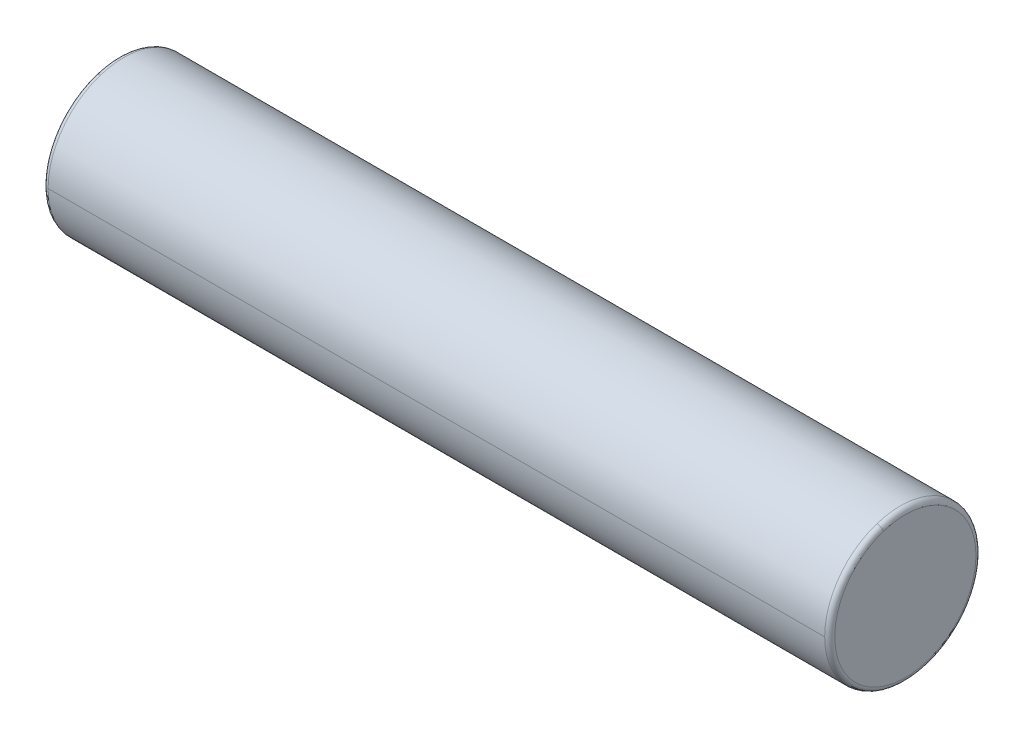
ISO-10303-21;
HEADER;
FILE_DESCRIPTION(('STEP AP214'),'2;1');
FILE_NAME('part.step','',(''),(''),'','','');
FILE_SCHEMA(('AUTOMOTIVE_DESIGN { 1 0 10303 214 1 1 1 1 }'));
ENDSEC;
DATA;
#1=APPLICATION_CONTEXT('core data for automotive mechanical design processes');
#2=APPLICATION_PROTOCOL_DEFINITION('international standard','automotive_design',2000,#1);
#3=PRODUCT_CONTEXT('',#1,'mechanical');
#4=PRODUCT('Part','Part','',(#3));
#5=PRODUCT_RELATED_PRODUCT_CATEGORY('part','',(#4));
#6=PRODUCT_DEFINITION_FORMATION('','',#4);
#7=PRODUCT_DEFINITION_CONTEXT('part definition',#1,'design');
#8=PRODUCT_DEFINITION('design','',#6,#7);
#9=PRODUCT_DEFINITION_SHAPE('','',#8);
#10=(LENGTH_UNIT() NAMED_UNIT(*) SI_UNIT(.MILLI.,.METRE.));
#11=(NAMED_UNIT(*) PLANE_ANGLE_UNIT() SI_UNIT($,.RADIAN.));
#12=(NAMED_UNIT(*) SI_UNIT($,.STERADIAN.) SOLID_ANGLE_UNIT());
#13=UNCERTAINTY_MEASURE_WITH_UNIT(LENGTH_MEASURE(1.E-05),#10,'distance_accuracy_value','');
#14=(GEOMETRIC_REPRESENTATION_CONTEXT(3) GLOBAL_UNCERTAINTY_ASSIGNED_CONTEXT((#13)) GLOBAL_UNIT_ASSIGNED_CONTEXT((#10,
#11,#12)) REPRESENTATION_CONTEXT('',''));
#15=CARTESIAN_POINT('',(0.,0.,0.));
#16=DIRECTION('',(0.,0.,1.));
#17=DIRECTION('',(1.,0.,0.));
#18=AXIS2_PLACEMENT_3D('',#15,#16,#17);
#19=CARTESIAN_POINT('',(2.1,3.25,0.));
#20=DIRECTION('',(1.,0.,0.));
#21=DIRECTION('',(0.,0.,-1.));
#22=AXIS2_PLACEMENT_3D('',#19,#20,#21);
#23=PLANE('',#22);
#24=CARTESIAN_POINT('',(2.1,3.91573956140652,0.216311896062434));
#25=CARTESIAN_POINT('',(2.1,3.91220039378035,0.227205120242794));
#26=CARTESIAN_POINT('',(2.1,3.90839342079429,0.238011307449353));
#27=CARTESIAN_POINT('',(2.1,3.90025403376515,0.259423954343163));
#28=CARTESIAN_POINT('',(2.1,3.89592161972208,0.270030414030415));
#29=CARTESIAN_POINT('',(2.1,3.88674152024174,0.291017952313907));
#30=CARTESIAN_POINT('',(2.1,3.88189383480447,0.301399030910147));
#31=CARTESIAN_POINT('',(2.1,3.87169494271154,0.321910825329425));
#32=CARTESIAN_POINT('',(2.1,3.86634373605587,0.332041541152462));
#33=CARTESIAN_POINT('',(2.1,3.85515067384589,0.352028196943182));
#34=CARTESIAN_POINT('',(2.1,3.84930881829157,0.361884136910865));
#35=CARTESIAN_POINT('',(2.1,3.8371485369722,0.381297499124348));
#36=CARTESIAN_POINT('',(2.1,3.83083011120713,0.390854921370148));
#37=CARTESIAN_POINT('',(2.1,3.81773190972843,0.409648222948401));
#38=CARTESIAN_POINT('',(2.1,3.8109521340148,0.418884102280853));
#39=CARTESIAN_POINT('',(2.1,3.79694756608198,0.437012068130574));
#40=CARTESIAN_POINT('',(2.1,3.78972277386278,0.445904154647843));
#41=CARTESIAN_POINT('',(2.1,3.77484557797712,0.463323113014291));
#42=CARTESIAN_POINT('',(2.1,3.76719317431064,0.47184998486347));
#43=CARTESIAN_POINT('',(2.1,3.75147919086763,0.48851797192267));
#44=CARTESIAN_POINT('',(2.1,3.7434176110911,0.496659087132692));
#45=CARTESIAN_POINT('',(2.1,3.72690469647266,0.512535948251258));
#46=CARTESIAN_POINT('',(2.1,3.71845336163076,0.520271694159802));
#47=CARTESIAN_POINT('',(2.1,3.70118129688937,0.535319180586672));
#48=CARTESIAN_POINT('',(2.1,3.69236056698989,0.542630921104998));
#49=CARTESIAN_POINT('',(2.1,3.67437096204376,0.556812782127896));
#50=CARTESIAN_POINT('',(2.1,3.66520208699712,0.563682902632468));
#51=CARTESIAN_POINT('',(2.1,3.64653828037989,0.576964972905863));
#52=CARTESIAN_POINT('',(2.1,3.63704334880931,0.583376922674686));
#53=CARTESIAN_POINT('',(2.1,3.61775030326599,0.595727204527956));
#54=CARTESIAN_POINT('',(2.1,3.60795218929324,0.601665536612403));
#55=CARTESIAN_POINT('',(2.1,3.58807638346038,0.613054277134795));
#56=CARTESIAN_POINT('',(2.1,3.57799869160026,0.618504685572741));
#57=CARTESIAN_POINT('',(2.1,3.55758800803502,0.628904448290805));
#58=CARTESIAN_POINT('',(2.1,3.54725501632991,0.633853802570923));
#59=CARTESIAN_POINT('',(2.1,3.52635862615678,0.643239533545359));
#60=CARTESIAN_POINT('',(2.1,3.51579522768877,0.647675910239676));
#61=CARTESIAN_POINT('',(2.1,3.49446347214198,0.656024998422473));
#62=CARTESIAN_POINT('',(2.1,3.4836951150632,0.659937709910952));
#63=CARTESIAN_POINT('',(2.1,3.46197938421031,0.667230041617384));
#64=CARTESIAN_POINT('',(2.1,3.45103201043618,0.670609661835336));
#65=CARTESIAN_POINT('',(2.1,3.42898461937487,0.676827669199589));
#66=CARTESIAN_POINT('',(2.1,3.41788460208769,0.679666056345889));
#67=CARTESIAN_POINT('',(2.1,3.39555866491416,0.68479475964359));
#68=CARTESIAN_POINT('',(2.1,3.38433274502782,0.68708507579499));
#69=CARTESIAN_POINT('',(2.1,3.36178204688025,0.691112119530673));
#70=CARTESIAN_POINT('',(2.1,3.35045726861902,0.692848847114956));
#71=CARTESIAN_POINT('',(2.1,3.32773613610444,0.695764529787534));
#72=CARTESIAN_POINT('',(2.1,3.31633978185109,0.69694348487583));
#73=CARTESIAN_POINT('',(2.1,3.29350295216788,0.698740782350362));
#74=CARTESIAN_POINT('',(2.1,3.28206247673801,0.699359124736598));
#75=CARTESIAN_POINT('',(2.1,3.25916496580913,0.700033707166043));
#76=CARTESIAN_POINT('',(2.1,3.24770793031013,0.700089947209252));
#77=CARTESIAN_POINT('',(2.1,3.224804900245,0.699640189465451));
#78=CARTESIAN_POINT('',(2.1,3.21335890567888,0.699134191678441));
#79=CARTESIAN_POINT('',(2.1,3.19050553188301,0.697561177267193));
#80=CARTESIAN_POINT('',(2.1,3.17909815265324,0.696494160642954));
#81=CARTESIAN_POINT('',(2.1,3.15634949090581,0.693801679093756));
#82=CARTESIAN_POINT('',(2.1,3.14500820838813,0.692176214168796));
#83=CARTESIAN_POINT('',(2.1,3.12241906220783,0.688370751905532));
#84=CARTESIAN_POINT('',(2.1,3.11117119854521,0.686190754567228));
#85=CARTESIAN_POINT('',(2.1,3.08879598716377,0.68128147928181));
#86=CARTESIAN_POINT('',(2.1,3.07766863944495,0.678552201334696));
#87=CARTESIAN_POINT('',(2.1,3.05556126670643,0.672550939901289));
#88=CARTESIAN_POINT('',(2.1,3.04458124168672,0.669278956414996));
#89=CARTESIAN_POINT('',(2.1,3.02279496618842,0.662200166398041));
#90=CARTESIAN_POINT('',(2.1,3.01198871570982,0.658393359867379));
#91=CARTESIAN_POINT('',(2.1,2.99057602249767,0.650254094692056));
#92=CARTESIAN_POINT('',(2.1,2.9799695797641,0.645921636047394));
#93=CARTESIAN_POINT('',(2.1,2.95898205389158,0.636741503916425));
#94=CARTESIAN_POINT('',(2.1,2.94860097075261,0.631893830430117));
#95=CARTESIAN_POINT('',(2.1,2.92808917300782,0.621694947085891));
#96=CARTESIAN_POINT('',(2.1,2.91795845840201,0.616343737227972));
#97=CARTESIAN_POINT('',(2.1,2.89797180350235,0.605150672673781));
#98=CARTESIAN_POINT('',(2.1,2.88811586320852,0.599308817977509));
#99=CARTESIAN_POINT('',(2.1,2.86870250075627,0.587148537286261));
#100=CARTESIAN_POINT('',(2.1,2.85914507859786,0.580830111291285));
#101=CARTESIAN_POINT('',(2.1,2.84035177708359,0.567731909644281));
#102=CARTESIAN_POINT('',(2.1,2.83111589772772,0.560952133992252));
#103=CARTESIAN_POINT('',(2.1,2.81298793186086,0.546947566104525));
#104=CARTESIAN_POINT('',(2.1,2.80409584534986,0.539722773868827));
#105=CARTESIAN_POINT('',(2.1,2.78667688698801,0.524845577971075));
#106=CARTESIAN_POINT('',(2.1,2.77815001513715,0.517193174309021));
#107=CARTESIAN_POINT('',(2.1,2.76148202807672,0.501479190869249));
#108=CARTESIAN_POINT('',(2.1,2.75334091286714,0.493417611091532));
#109=CARTESIAN_POINT('',(2.1,2.73746405174891,0.47690469647223));
#110=CARTESIAN_POINT('',(2.1,2.72972830584024,0.468453361630645));
#111=CARTESIAN_POINT('',(2.1,2.71468081941328,0.451181296889491));
#112=CARTESIAN_POINT('',(2.1,2.70736907889499,0.442360566989922));
#113=CARTESIAN_POINT('',(2.1,2.69318721787212,0.424370962043732));
#114=CARTESIAN_POINT('',(2.1,2.68631709736754,0.41520208699711));
#115=CARTESIAN_POINT('',(2.1,2.67303502709413,0.396538280379902));
#116=CARTESIAN_POINT('',(2.1,2.66662307732531,0.387043348809315));
#117=CARTESIAN_POINT('',(2.1,2.65427279547205,0.367750303265987));
#118=CARTESIAN_POINT('',(2.1,2.6483344633876,0.357952189293245));
#119=CARTESIAN_POINT('',(2.1,2.6369457228652,0.338076383460381));
#120=CARTESIAN_POINT('',(2.1,2.63149531442726,0.327998691600258));
#121=CARTESIAN_POINT('',(2.1,2.6210955517092,0.307588008035025));
#122=CARTESIAN_POINT('',(2.1,2.61614619742908,0.297255016329914));
#123=CARTESIAN_POINT('',(2.1,2.60676046645464,0.276358626156785));
#124=CARTESIAN_POINT('',(2.1,2.60232408976032,0.265795227688766));
#125=CARTESIAN_POINT('',(2.1,2.59397500157753,0.244463472141978));
#126=CARTESIAN_POINT('',(2.1,2.59006229008906,0.233695115063208));
#127=CARTESIAN_POINT('',(2.1,2.58276995838261,0.211979384210306));
#128=CARTESIAN_POINT('',(2.1,2.57939033816463,0.201032010436173));
#129=CARTESIAN_POINT('',(2.1,2.57317233080044,0.178984619374884));
#130=CARTESIAN_POINT('',(2.1,2.57033394365423,0.167884602087726));
#131=CARTESIAN_POINT('',(2.1,2.56520524035629,0.145558664914134));
#132=CARTESIAN_POINT('',(2.1,2.56291492420456,0.134332745027699));
#133=CARTESIAN_POINT('',(2.1,2.55888788046978,0.111782046880368));
#134=CARTESIAN_POINT('',(2.1,2.55715115288672,0.100457268619472));
#135=CARTESIAN_POINT('',(2.1,2.5542354702108,0.0777361361039879));
#136=CARTESIAN_POINT('',(2.1,2.55305651511793,0.0663397818494006));
#137=CARTESIAN_POINT('',(2.1,2.55125921765588,0.0435029521695724));
#138=CARTESIAN_POINT('',(2.1,2.55064087528668,0.0320624767443316));
#139=CARTESIAN_POINT('',(2.1,2.54996629281068,0.00916496580281616));
#140=CARTESIAN_POINT('',(2.1,2.54991005270386,-0.00229206971345843));
#141=CARTESIAN_POINT('',(2.1,2.55035981062143,-0.0251950997314124));
#142=CARTESIAN_POINT('',(2.1,2.55086580864581,-0.0366410942330917));
#143=CARTESIAN_POINT('',(2.1,2.55243882240855,-0.0594944682050133));
#144=CARTESIAN_POINT('',(2.1,2.55350583814691,-0.0709018476752554));
#145=CARTESIAN_POINT('',(2.1,2.55619832211637,-0.0936505087656896));
#146=CARTESIAN_POINT('',(2.1,2.55782379034747,-0.104991790385882));
#147=CARTESIAN_POINT('',(2.1,2.5616292435782,-0.127580939018153));
#148=CARTESIAN_POINT('',(2.1,2.56380922857782,-0.138828806030232));
#149=CARTESIAN_POINT('',(2.1,2.56871853757314,-0.161204008260792));
#150=CARTESIAN_POINT('',(2.1,2.57144786156883,-0.172331343479273));
#151=CARTESIAN_POINT('',(2.1,2.57744899719519,-0.194438750369344));
#152=CARTESIAN_POINT('',(2.1,2.58072080882586,-0.205418822040934));
#153=CARTESIAN_POINT('',(2.1,2.58426043859348,-0.216311896062432));
#154=B_SPLINE_CURVE_WITH_KNOTS('',3,(#24,#25,#26,#27,#28,#29,#30,#31,#32,#33,#34,#35,#36,#37,
#38,#39,#40,#41,#42,#43,#44,#45,#46,#47,#48,#49,#50,#51,#52,#53,#54,#55,#56,#57,#58,#59,#60,#61,
#62,#63,#64,#65,#66,#67,#68,#69,#70,#71,#72,#73,#74,#75,#76,#77,#78,#79,#80,#81,#82,#83,#84,#85,
#86,#87,#88,#89,#90,#91,#92,#93,#94,#95,#96,#97,#98,#99,#100,#101,#102,#103,#104,#105,#106,#107,
#108,#109,#110,#111,#112,#113,#114,#115,#116,#117,#118,#119,#120,#121,#122,#123,#124,#125,#126,
#127,#128,#129,#130,#131,#132,#133,#134,#135,#136,#137,#138,#139,#140,#141,#142,#143,#144,#145,
#146,#147,#148,#149,#150,#151,#152,#153),.UNSPECIFIED.,.F.,.F.,(4,2,2,2,2,2,2,2,2,2,2,2,2,2,2,2,
2,2,2,2,2,2,2,2,2,2,2,2,2,2,2,2,2,2,2,2,2,2,2,2,2,2,2,2,2,2,2,2,2,2,2,2,2,2,2,2,2,2,2,2,2,2,2,2,
4),(0.,0.0343577199320727,0.0687154398641451,0.103073159796218,0.13743087972829,
0.171788599660363,0.206146319592435,0.240504039524508,0.274861759456581,0.309219479388653,
0.343577199320725,0.377934919252798,0.412292639184871,0.446650359116943,0.481008079049016,
0.515365798981088,0.549723518913161,0.584081238845233,0.618438958777306,0.652796678709379,
0.687154398641451,0.721512118573523,0.755869838505596,0.790227558437669,0.824585278369741,
0.858942998301814,0.893300718233886,0.927658438165959,0.962016158098031,0.996373878030104,
1.03073159796218,1.06508931789425,1.09944703782632,1.13380475775839,1.16816247769047,
1.20252019762254,1.23687791755461,1.27123563748668,1.30559335741876,1.33995107735083,
1.3743087972829,1.40866651721497,1.44302423714705,1.47738195707912,1.51173967701119,
1.54609739694326,1.58045511687534,1.61481283680741,1.64917055673948,1.68352827667155,
1.71788599660363,1.7522437165357,1.78660143646777,1.82095915639984,1.85531687633192,
1.88967459626399,1.92403231619606,1.95839003612813,1.99274775606021,2.02710547599228,
2.06146319592435,2.09582091585642,2.1301786357885,2.16453635572057,2.19889407565264),.UNSPECIFIED.);
#155=CARTESIAN_POINT('',(2.1,3.91573956140652,0.216311896062434));
#156=VERTEX_POINT('',#155);
#157=CARTESIAN_POINT('',(2.1,2.58426043859348,-0.216311896062434));
#158=VERTEX_POINT('',#157);
#159=EDGE_CURVE('E11',#156,#158,#154,.T.);
#160=ORIENTED_EDGE('',*,*,#159,.F.);
#161=CARTESIAN_POINT('',(2.1,2.58426043859348,-0.216311896062434));
#162=CARTESIAN_POINT('',(2.1,2.58779960621965,-0.227205120242794));
#163=CARTESIAN_POINT('',(2.1,2.59160657920571,-0.238011307449352));
#164=CARTESIAN_POINT('',(2.1,2.59974596623485,-0.259423954343163));
#165=CARTESIAN_POINT('',(2.1,2.60407838027792,-0.270030414030415));
#166=CARTESIAN_POINT('',(2.1,2.61325847975826,-0.291017952313907));
#167=CARTESIAN_POINT('',(2.1,2.61810616519553,-0.301399030910147));
#168=CARTESIAN_POINT('',(2.1,2.62830505728846,-0.321910825329424));
#169=CARTESIAN_POINT('',(2.1,2.63365626394413,-0.332041541152462));
#170=CARTESIAN_POINT('',(2.1,2.64484932615411,-0.352028196943182));
#171=CARTESIAN_POINT('',(2.1,2.65069118170843,-0.361884136910865));
#172=CARTESIAN_POINT('',(2.1,2.6628514630278,-0.381297499124348));
#173=CARTESIAN_POINT('',(2.1,2.66916988879287,-0.390854921370148));
#174=CARTESIAN_POINT('',(2.1,2.68226809027157,-0.409648222948401));
#175=CARTESIAN_POINT('',(2.1,2.6890478659852,-0.418884102280853));
#176=CARTESIAN_POINT('',(2.1,2.70305243391802,-0.437012068130574));
#177=CARTESIAN_POINT('',(2.1,2.71027722613721,-0.445904154647843));
#178=CARTESIAN_POINT('',(2.1,2.72515442202288,-0.463323113014291));
#179=CARTESIAN_POINT('',(2.1,2.73280682568936,-0.47184998486347));
#180=CARTESIAN_POINT('',(2.1,2.74852080913237,-0.48851797192267));
#181=CARTESIAN_POINT('',(2.1,2.7565823889089,-0.496659087132692));
#182=CARTESIAN_POINT('',(2.1,2.77309530352734,-0.512535948251258));
#183=CARTESIAN_POINT('',(2.1,2.78154663836924,-0.520271694159802));
#184=CARTESIAN_POINT('',(2.1,2.79881870311063,-0.535319180586672));
#185=CARTESIAN_POINT('',(2.1,2.80763943301011,-0.542630921104998));
#186=CARTESIAN_POINT('',(2.1,2.82562903795624,-0.556812782127896));
#187=CARTESIAN_POINT('',(2.1,2.83479791300288,-0.563682902632468));
#188=CARTESIAN_POINT('',(2.1,2.85346171962011,-0.576964972905863));
#189=CARTESIAN_POINT('',(2.1,2.86295665119069,-0.583376922674686));
#190=CARTESIAN_POINT('',(2.1,2.88224969673401,-0.595727204527956));
#191=CARTESIAN_POINT('',(2.1,2.89204781070675,-0.601665536612402));
#192=CARTESIAN_POINT('',(2.1,2.91192361653962,-0.613054277134795));
#193=CARTESIAN_POINT('',(2.1,2.92200130839974,-0.618504685572741));
#194=CARTESIAN_POINT('',(2.1,2.94241199196498,-0.628904448290805));
#195=CARTESIAN_POINT('',(2.1,2.95274498367009,-0.633853802570923));
#196=CARTESIAN_POINT('',(2.1,2.97364137384322,-0.643239533545359));
#197=CARTESIAN_POINT('',(2.1,2.98420477231123,-0.647675910239676));
#198=CARTESIAN_POINT('',(2.1,3.00553652785802,-0.656024998422473));
#199=CARTESIAN_POINT('',(2.1,3.01630488493679,-0.659937709910952));
#200=CARTESIAN_POINT('',(2.1,3.03802061578969,-0.667230041617384));
#201=CARTESIAN_POINT('',(2.1,3.04896798956382,-0.670609661835336));
#202=CARTESIAN_POINT('',(2.1,3.07101538062513,-0.676827669199589));
#203=CARTESIAN_POINT('',(2.1,3.08211539791231,-0.679666056345889));
#204=CARTESIAN_POINT('',(2.1,3.10444133508583,-0.68479475964359));
#205=CARTESIAN_POINT('',(2.1,3.11566725497218,-0.68708507579499));
#206=CARTESIAN_POINT('',(2.1,3.13821795311975,-0.691112119530673));
#207=CARTESIAN_POINT('',(2.1,3.14954273138098,-0.692848847114955));
#208=CARTESIAN_POINT('',(2.1,3.17226386389556,-0.695764529787534));
#209=CARTESIAN_POINT('',(2.1,3.18366021814891,-0.69694348487583));
#210=CARTESIAN_POINT('',(2.1,3.20649704783212,-0.698740782350362));
#211=CARTESIAN_POINT('',(2.1,3.21793752326199,-0.699359124736598));
#212=CARTESIAN_POINT('',(2.1,3.24083503419086,-0.700033707166044));
#213=CARTESIAN_POINT('',(2.1,3.25229206968987,-0.700089947209252));
#214=CARTESIAN_POINT('',(2.1,3.275195099755,-0.699640189465451));
#215=CARTESIAN_POINT('',(2.1,3.28664109432111,-0.699134191678441));
#216=CARTESIAN_POINT('',(2.1,3.30949446811699,-0.697561177267193));
#217=CARTESIAN_POINT('',(2.1,3.32090184734675,-0.696494160642955));
#218=CARTESIAN_POINT('',(2.1,3.34365050909419,-0.693801679093756));
#219=CARTESIAN_POINT('',(2.1,3.35499179161187,-0.692176214168796));
#220=CARTESIAN_POINT('',(2.1,3.37758093779217,-0.688370751905532));
#221=CARTESIAN_POINT('',(2.1,3.38882880145479,-0.686190754567228));
#222=CARTESIAN_POINT('',(2.1,3.41120401283623,-0.68128147928181));
#223=CARTESIAN_POINT('',(2.1,3.42233136055505,-0.678552201334696));
#224=CARTESIAN_POINT('',(2.1,3.44443873329357,-0.672550939901289));
#225=CARTESIAN_POINT('',(2.1,3.45541875831328,-0.669278956414996));
#226=CARTESIAN_POINT('',(2.1,3.47720503381158,-0.662200166398041));
#227=CARTESIAN_POINT('',(2.1,3.48801128429018,-0.658393359867379));
#228=CARTESIAN_POINT('',(2.1,3.50942397750233,-0.650254094692056));
#229=CARTESIAN_POINT('',(2.1,3.52003042023589,-0.645921636047394));
#230=CARTESIAN_POINT('',(2.1,3.54101794610842,-0.636741503916425));
#231=CARTESIAN_POINT('',(2.1,3.55139902924739,-0.631893830430118));
#232=CARTESIAN_POINT('',(2.1,3.57191082699218,-0.621694947085891));
#233=CARTESIAN_POINT('',(2.1,3.58204154159799,-0.616343737227972));
#234=CARTESIAN_POINT('',(2.1,3.60202819649765,-0.605150672673781));
#235=CARTESIAN_POINT('',(2.1,3.61188413679148,-0.59930881797751));
#236=CARTESIAN_POINT('',(2.1,3.63129749924373,-0.587148537286262));
#237=CARTESIAN_POINT('',(2.1,3.64085492140213,-0.580830111291286));
#238=CARTESIAN_POINT('',(2.1,3.65964822291641,-0.567731909644281));
#239=CARTESIAN_POINT('',(2.1,3.66888410227228,-0.560952133992252));
#240=CARTESIAN_POINT('',(2.1,3.68701206813914,-0.546947566104526));
#241=CARTESIAN_POINT('',(2.1,3.69590415465014,-0.539722773868828));
#242=CARTESIAN_POINT('',(2.1,3.71332311301199,-0.524845577971076));
#243=CARTESIAN_POINT('',(2.1,3.72184998486285,-0.517193174309021));
#244=CARTESIAN_POINT('',(2.1,3.73851797192328,-0.50147919086925));
#245=CARTESIAN_POINT('',(2.1,3.74665908713285,-0.493417611091533));
#246=CARTESIAN_POINT('',(2.1,3.76253594825109,-0.476904696472231));
#247=CARTESIAN_POINT('',(2.1,3.77027169415976,-0.468453361630646));
#248=CARTESIAN_POINT('',(2.1,3.78531918058671,-0.451181296889492));
#249=CARTESIAN_POINT('',(2.1,3.79263092110501,-0.442360566989923));
#250=CARTESIAN_POINT('',(2.1,3.80681278212788,-0.424370962043733));
#251=CARTESIAN_POINT('',(2.1,3.81368290263246,-0.415202086997111));
#252=CARTESIAN_POINT('',(2.1,3.82696497290586,-0.396538280379903));
#253=CARTESIAN_POINT('',(2.1,3.83337692267469,-0.387043348809316));
#254=CARTESIAN_POINT('',(2.1,3.84572720452795,-0.367750303265988));
#255=CARTESIAN_POINT('',(2.1,3.8516655366124,-0.357952189293246));
#256=CARTESIAN_POINT('',(2.1,3.86305427713479,-0.338076383460382));
#257=CARTESIAN_POINT('',(2.1,3.86850468557274,-0.327998691600259));
#258=CARTESIAN_POINT('',(2.1,3.8789044482908,-0.307588008035026));
#259=CARTESIAN_POINT('',(2.1,3.88385380257092,-0.297255016329915));
#260=CARTESIAN_POINT('',(2.1,3.89323953354536,-0.276358626156786));
#261=CARTESIAN_POINT('',(2.1,3.89767591023968,-0.265795227688767));
#262=CARTESIAN_POINT('',(2.1,3.90602499842247,-0.244463472141979));
#263=CARTESIAN_POINT('',(2.1,3.90993770991094,-0.233695115063209));
#264=CARTESIAN_POINT('',(2.1,3.91723004161739,-0.211979384210307));
#265=CARTESIAN_POINT('',(2.1,3.92060966183537,-0.201032010436174));
#266=CARTESIAN_POINT('',(2.1,3.92682766919956,-0.178984619374885));
#267=CARTESIAN_POINT('',(2.1,3.92966605634577,-0.167884602087727));
#268=CARTESIAN_POINT('',(2.1,3.93479475964371,-0.145558664914135));
#269=CARTESIAN_POINT('',(2.1,3.93708507579544,-0.134332745027701));
#270=CARTESIAN_POINT('',(2.1,3.94111211953022,-0.111782046880369));
#271=CARTESIAN_POINT('',(2.1,3.94284884711328,-0.100457268619473));
#272=CARTESIAN_POINT('',(2.1,3.9457645297892,-0.0777361361039888));
#273=CARTESIAN_POINT('',(2.1,3.94694348488207,-0.0663397818494017));
#274=CARTESIAN_POINT('',(2.1,3.94874078234412,-0.0435029521695738));
#275=CARTESIAN_POINT('',(2.1,3.94935912471332,-0.0320624767443329));
#276=CARTESIAN_POINT('',(2.1,3.95003370718932,-0.0091649658028175));
#277=CARTESIAN_POINT('',(2.1,3.95008994729613,0.00229206971345708));
#278=CARTESIAN_POINT('',(2.1,3.94964018937857,0.025195099731411));
#279=CARTESIAN_POINT('',(2.1,3.94913419135419,0.0366410942330904));
#280=CARTESIAN_POINT('',(2.1,3.94756117759145,0.0594944682050119));
#281=CARTESIAN_POINT('',(2.1,3.94649416185309,0.0709018476752541));
#282=CARTESIAN_POINT('',(2.1,3.94380167788363,0.0936505087656885));
#283=CARTESIAN_POINT('',(2.1,3.94217620965253,0.104991790385881));
#284=CARTESIAN_POINT('',(2.1,3.9383707564218,0.127580939018152));
#285=CARTESIAN_POINT('',(2.1,3.93619077142218,0.138828806030232));
#286=CARTESIAN_POINT('',(2.1,3.93128146242686,0.161204008260792));
#287=CARTESIAN_POINT('',(2.1,3.92855213843117,0.172331343479273));
#288=CARTESIAN_POINT('',(2.1,3.92255100280481,0.194438750369343));
#289=CARTESIAN_POINT('',(2.1,3.91927919117414,0.205418822040933));
#290=CARTESIAN_POINT('',(2.1,3.91573956140652,0.21631189606243));
#291=B_SPLINE_CURVE_WITH_KNOTS('',3,(#161,#162,#163,#164,#165,#166,#167,#168,#169,#170,#171,
#172,#173,#174,#175,#176,#177,#178,#179,#180,#181,#182,#183,#184,#185,#186,#187,#188,#189,#190,
#191,#192,#193,#194,#195,#196,#197,#198,#199,#200,#201,#202,#203,#204,#205,#206,#207,#208,#209,
#210,#211,#212,#213,#214,#215,#216,#217,#218,#219,#220,#221,#222,#223,#224,#225,#226,#227,#228,
#229,#230,#231,#232,#233,#234,#235,#236,#237,#238,#239,#240,#241,#242,#243,#244,#245,#246,#247,
#248,#249,#250,#251,#252,#253,#254,#255,#256,#257,#258,#259,#260,#261,#262,#263,#264,#265,#266,
#267,#268,#269,#270,#271,#272,#273,#274,#275,#276,#277,#278,#279,#280,#281,#282,#283,#284,#285,
#286,#287,#288,#289,#290),.UNSPECIFIED.,.F.,.F.,(4,2,2,2,2,2,2,2,2,2,2,2,2,2,2,2,2,2,2,2,2,2,2,
2,2,2,2,2,2,2,2,2,2,2,2,2,2,2,2,2,2,2,2,2,2,2,2,2,2,2,2,2,2,2,2,2,2,2,2,2,2,2,2,2,4),(0.,
0.0343577199320725,0.0687154398641449,0.103073159796218,0.13743087972829,0.171788599660363,
0.206146319592435,0.240504039524507,0.27486175945658,0.309219479388653,0.343577199320725,
0.377934919252798,0.41229263918487,0.446650359116943,0.481008079049015,0.515365798981088,
0.54972351891316,0.584081238845233,0.618438958777306,0.652796678709378,0.687154398641451,
0.721512118573523,0.755869838505595,0.790227558437668,0.82458527836974,0.858942998301813,
0.893300718233886,0.927658438165958,0.962016158098031,0.996373878030103,1.03073159796218,
1.06508931789425,1.09944703782632,1.13380475775839,1.16816247769047,1.20252019762254,
1.23687791755461,1.27123563748668,1.30559335741876,1.33995107735083,1.3743087972829,
1.40866651721497,1.44302423714705,1.47738195707912,1.51173967701119,1.54609739694326,
1.58045511687534,1.61481283680741,1.64917055673948,1.68352827667155,1.71788599660363,
1.7522437165357,1.78660143646777,1.82095915639984,1.85531687633192,1.88967459626399,
1.92403231619606,1.95839003612813,1.99274775606021,2.02710547599228,2.06146319592435,
2.09582091585642,2.1301786357885,2.16453635572057,2.19889407565264),.UNSPECIFIED.);
#292=EDGE_CURVE('E26',#158,#156,#291,.T.);
#293=ORIENTED_EDGE('',*,*,#292,.F.);
#294=EDGE_LOOP('',(#160,#293));
#295=FACE_BOUND('',#294,.T.);
#296=ADVANCED_FACE('F17',(#295),#23,.F.);
#297=CARTESIAN_POINT('',(2.15000000000009,3.25,0.));
#298=DIRECTION('',(1.,0.,0.));
#299=DIRECTION('',(0.,-0.309016994374947,0.951056516295154));
#300=AXIS2_PLACEMENT_3D('',#297,#298,#299);
#301=TOROIDAL_SURFACE('',#300,0.699999999999906,0.0500000000000938);
#302=CARTESIAN_POINT('',(2.15000000000009,2.58426043859348,-0.216311896062434));
#303=DIRECTION('',(0.,0.309016994374946,-0.951056516295154));
#304=DIRECTION('',(-1.90070181815469E-12,-0.951056516295154,-0.309016994374946));
#305=AXIS2_PLACEMENT_3D('',#302,#303,#304);
#306=CIRCLE('',#305,0.0500000000000941);
#307=CARTESIAN_POINT('',(2.15,2.53670761277863,-0.23176274578121));
#308=VERTEX_POINT('',#307);
#309=EDGE_CURVE('E139',#308,#158,#306,.T.);
#310=ORIENTED_EDGE('',*,*,#309,.T.);
#311=ORIENTED_EDGE('',*,*,#292,.T.);
#312=CARTESIAN_POINT('',(2.15000000000009,3.91573956140652,0.216311896062434));
#313=DIRECTION('',(0.,-0.309016994374946,0.951056516295154));
#314=DIRECTION('',(-1.90070181815469E-12,0.951056516295154,0.309016994374946));
#315=AXIS2_PLACEMENT_3D('',#312,#313,#314);
#316=CIRCLE('',#315,0.0500000000000941);
#317=CARTESIAN_POINT('',(2.15,3.96329238722137,0.23176274578121));
#318=VERTEX_POINT('',#317);
#319=EDGE_CURVE('E135',#318,#156,#316,.T.);
#320=ORIENTED_EDGE('',*,*,#319,.F.);
#321=CARTESIAN_POINT('',(2.15,3.25,0.));
#322=DIRECTION('',(1.,0.,0.));
#323=DIRECTION('',(0.,0.,-1.));
#324=AXIS2_PLACEMENT_3D('',#321,#322,#323);
#325=CIRCLE('',#324,0.75);
#326=CARTESIAN_POINT('',(2.15,3.25,-0.75));
#327=VERTEX_POINT('',#326);
#328=EDGE_CURVE('E130',#327,#318,#325,.T.);
#329=ORIENTED_EDGE('',*,*,#328,.F.);
#330=CARTESIAN_POINT('',(2.15,3.25,0.));
#331=DIRECTION('',(1.,0.,0.));
#332=DIRECTION('',(0.,0.,-1.));
#333=AXIS2_PLACEMENT_3D('',#330,#331,#332);
#334=CIRCLE('',#333,0.75);
#335=EDGE_CURVE('E125',#308,#327,#334,.T.);
#336=ORIENTED_EDGE('',*,*,#335,.F.);
#337=EDGE_LOOP('',(#310,#311,#320,#329,#336));
#338=FACE_BOUND('',#337,.T.);
#339=ADVANCED_FACE('F146',(#338),#301,.T.);
#340=CARTESIAN_POINT('',(9.9,3.25,0.));
#341=DIRECTION('',(1.,0.,0.));
#342=DIRECTION('',(0.,1.,0.));
#343=AXIS2_PLACEMENT_3D('',#340,#341,#342);
#344=CYLINDRICAL_SURFACE('',#343,0.75);
#345=DIRECTION('',(1.,0.,0.));
#346=VECTOR('',#345,1.);
#347=CARTESIAN_POINT('',(2.15,3.25,0.75));
#348=LINE('',#347,#346);
#349=CARTESIAN_POINT('',(2.15,3.25,0.75));
#350=VERTEX_POINT('',#349);
#351=CARTESIAN_POINT('',(9.85,3.25,0.75));
#352=VERTEX_POINT('',#351);
#353=EDGE_CURVE('E92',#350,#352,#348,.T.);
#354=ORIENTED_EDGE('',*,*,#353,.F.);
#355=CARTESIAN_POINT('',(2.15,3.25,0.));
#356=DIRECTION('',(1.,0.,0.));
#357=DIRECTION('',(0.,0.,-1.));
#358=AXIS2_PLACEMENT_3D('',#355,#356,#357);
#359=CIRCLE('',#358,0.75);
#360=EDGE_CURVE('E117',#350,#308,#359,.T.);
#361=ORIENTED_EDGE('',*,*,#360,.T.);
#362=ORIENTED_EDGE('',*,*,#335,.T.);
#363=DIRECTION('',(1.,0.,0.));
#364=VECTOR('',#363,1.);
#365=CARTESIAN_POINT('',(2.15,3.25,-0.75));
#366=LINE('',#365,#364);
#367=CARTESIAN_POINT('',(9.85,3.25,-0.75));
#368=VERTEX_POINT('',#367);
#369=EDGE_CURVE('E113',#327,#368,#366,.T.);
#370=ORIENTED_EDGE('',*,*,#369,.T.);
#371=CARTESIAN_POINT('',(9.85,3.25,0.));
#372=DIRECTION('',(1.,0.,0.));
#373=DIRECTION('',(0.,0.,-1.));
#374=AXIS2_PLACEMENT_3D('',#371,#372,#373);
#375=CIRCLE('',#374,0.75);
#376=CARTESIAN_POINT('',(9.85,2.53670761277863,-0.23176274578121));
#377=VERTEX_POINT('',#376);
#378=EDGE_CURVE('E84',#377,#368,#375,.T.);
#379=ORIENTED_EDGE('',*,*,#378,.F.);
#380=CARTESIAN_POINT('',(9.85,3.25,0.));
#381=DIRECTION('',(1.,0.,0.));
#382=DIRECTION('',(0.,0.,-1.));
#383=AXIS2_PLACEMENT_3D('',#380,#381,#382);
#384=CIRCLE('',#383,0.75);
#385=EDGE_CURVE('E106',#352,#377,#384,.T.);
#386=ORIENTED_EDGE('',*,*,#385,.F.);
#387=EDGE_LOOP('',(#354,#361,#362,#370,#379,#386));
#388=FACE_BOUND('',#387,.T.);
#389=ADVANCED_FACE('F155',(#388),#344,.T.);
#390=CARTESIAN_POINT('',(9.85,3.25,0.));
#391=DIRECTION('',(1.,0.,0.));
#392=DIRECTION('',(0.,0.309016994374947,-0.951056516295154));
#393=AXIS2_PLACEMENT_3D('',#390,#391,#392);
#394=TOROIDAL_SURFACE('',#393,0.699999999999904,0.050000000000096);
#395=CARTESIAN_POINT('',(9.85,2.58426043859348,-0.216311896062433));
#396=DIRECTION('',(0.,0.309016994374947,-0.951056516295154));
#397=DIRECTION('',(1.,0.,0.));
#398=AXIS2_PLACEMENT_3D('',#395,#396,#397);
#399=CIRCLE('',#398,0.0500000000000966);
#400=CARTESIAN_POINT('',(9.9000000000001,2.58426043859348,-0.216311896062433));
#401=VERTEX_POINT('',#400);
#402=EDGE_CURVE('E102',#401,#377,#399,.T.);
#403=ORIENTED_EDGE('',*,*,#402,.F.);
#404=CARTESIAN_POINT('',(9.9,3.25,0.));
#405=DIRECTION('',(1.,0.,0.));
#406=DIRECTION('',(0.,0.,-1.));
#407=AXIS2_PLACEMENT_3D('',#404,#405,#406);
#408=CIRCLE('',#407,0.7);
#409=CARTESIAN_POINT('',(9.9000000000001,3.91573956140652,0.216311896062434));
#410=VERTEX_POINT('',#409);
#411=EDGE_CURVE('E74',#410,#401,#408,.T.);
#412=ORIENTED_EDGE('',*,*,#411,.F.);
#413=CARTESIAN_POINT('',(9.85,3.91573956140652,0.216311896062433));
#414=DIRECTION('',(0.,-0.309016994374947,0.951056516295154));
#415=DIRECTION('',(1.,0.,0.));
#416=AXIS2_PLACEMENT_3D('',#413,#414,#415);
#417=CIRCLE('',#416,0.0500000000000966);
#418=CARTESIAN_POINT('',(9.85,3.96329238722137,0.231762745781211));
#419=VERTEX_POINT('',#418);
#420=EDGE_CURVE('E67',#410,#419,#417,.T.);
#421=ORIENTED_EDGE('',*,*,#420,.T.);
#422=CARTESIAN_POINT('',(9.85,3.25,0.));
#423=DIRECTION('',(1.,0.,0.));
#424=DIRECTION('',(0.,0.,-1.));
#425=AXIS2_PLACEMENT_3D('',#422,#423,#424);
#426=CIRCLE('',#425,0.75);
#427=EDGE_CURVE('E72',#419,#352,#426,.T.);
#428=ORIENTED_EDGE('',*,*,#427,.T.);
#429=ORIENTED_EDGE('',*,*,#385,.T.);
#430=EDGE_LOOP('',(#403,#412,#421,#428,#429));
#431=FACE_BOUND('',#430,.T.);
#432=ADVANCED_FACE('F69',(#431),#394,.T.);
#433=CARTESIAN_POINT('',(9.9,3.25,0.));
#434=DIRECTION('',(1.,0.,0.));
#435=DIRECTION('',(0.,-1.,0.));
#436=AXIS2_PLACEMENT_3D('',#433,#434,#435);
#437=CYLINDRICAL_SURFACE('',#436,0.75);
#438=ORIENTED_EDGE('',*,*,#353,.T.);
#439=ORIENTED_EDGE('',*,*,#427,.F.);
#440=CARTESIAN_POINT('',(9.85,3.25,0.));
#441=DIRECTION('',(1.,0.,0.));
#442=DIRECTION('',(0.,0.,-1.));
#443=AXIS2_PLACEMENT_3D('',#440,#441,#442);
#444=CIRCLE('',#443,0.75);
#445=EDGE_CURVE('E81',#368,#419,#444,.T.);
#446=ORIENTED_EDGE('',*,*,#445,.F.);
#447=ORIENTED_EDGE('',*,*,#369,.F.);
#448=ORIENTED_EDGE('',*,*,#328,.T.);
#449=CARTESIAN_POINT('',(2.15,3.25,0.));
#450=DIRECTION('',(1.,0.,0.));
#451=DIRECTION('',(0.,0.,-1.));
#452=AXIS2_PLACEMENT_3D('',#449,#450,#451);
#453=CIRCLE('',#452,0.75);
#454=EDGE_CURVE('E87',#318,#350,#453,.T.);
#455=ORIENTED_EDGE('',*,*,#454,.T.);
#456=EDGE_LOOP('',(#438,#439,#446,#447,#448,#455));
#457=FACE_BOUND('',#456,.T.);
#458=ADVANCED_FACE('F90',(#457),#437,.T.);
#459=CARTESIAN_POINT('',(2.15000000000009,3.25,0.));
#460=DIRECTION('',(1.,0.,0.));
#461=DIRECTION('',(0.,0.309016994374947,-0.951056516295154));
#462=AXIS2_PLACEMENT_3D('',#459,#460,#461);
#463=TOROIDAL_SURFACE('',#462,0.699999999999906,0.0500000000000938);
#464=ORIENTED_EDGE('',*,*,#309,.F.);
#465=ORIENTED_EDGE('',*,*,#360,.F.);
#466=ORIENTED_EDGE('',*,*,#454,.F.);
#467=ORIENTED_EDGE('',*,*,#319,.T.);
#468=ORIENTED_EDGE('',*,*,#159,.T.);
#469=EDGE_LOOP('',(#464,#465,#466,#467,#468));
#470=FACE_BOUND('',#469,.T.);
#471=ADVANCED_FACE('F164',(#470),#463,.T.);
#472=CARTESIAN_POINT('',(9.85,3.25,0.));
#473=DIRECTION('',(1.,0.,0.));
#474=DIRECTION('',(0.,-0.309016994374947,0.951056516295154));
#475=AXIS2_PLACEMENT_3D('',#472,#473,#474);
#476=TOROIDAL_SURFACE('',#475,0.699999999999904,0.050000000000096);
#477=ORIENTED_EDGE('',*,*,#402,.T.);
#478=ORIENTED_EDGE('',*,*,#378,.T.);
#479=ORIENTED_EDGE('',*,*,#445,.T.);
#480=ORIENTED_EDGE('',*,*,#420,.F.);
#481=CARTESIAN_POINT('',(9.9,2.58426043859339,-0.216311896062463));
#482=CARTESIAN_POINT('',(9.9,2.65228052141772,-0.425367142842009));
#483=CARTESIAN_POINT('',(9.9,2.80202972657809,-0.608308772771781));
#484=CARTESIAN_POINT('',(9.9,3.02130566124638,-0.719750933121307));
#485=CARTESIAN_POINT('',(9.9,3.492932666311,-0.747669867747458));
#486=CARTESIAN_POINT('',(9.9,3.85807659038147,-0.447867577010209));
#487=CARTESIAN_POINT('',(9.9,3.9699704896485,-0.228821814816915));
#488=CARTESIAN_POINT('',(9.9,3.98358974941431,0.00720144711070897));
#489=CARTESIAN_POINT('',(9.9,3.91573956140661,0.216311896062463));
#490=B_SPLINE_CURVE_WITH_KNOTS('',5,(#481,#482,#483,#484,#485,#486,#487,#488,#489),
.UNSPECIFIED.,.F.,.F.,(6,3,6),(0.,1.5707963267949,3.14159265358979),.UNSPECIFIED.);
#491=EDGE_CURVE('E185',#401,#410,#490,.T.);
#492=ORIENTED_EDGE('',*,*,#491,.F.);
#493=EDGE_LOOP('',(#477,#478,#479,#480,#492));
#494=FACE_BOUND('',#493,.T.);
#495=ADVANCED_FACE('F83',(#494),#476,.T.);
#496=CARTESIAN_POINT('',(9.9,3.95,0.));
#497=DIRECTION('',(-1.,0.,0.));
#498=DIRECTION('',(0.,0.,1.));
#499=AXIS2_PLACEMENT_3D('',#496,#497,#498);
#500=PLANE('',#499);
#501=ORIENTED_EDGE('',*,*,#491,.T.);
#502=ORIENTED_EDGE('',*,*,#411,.T.);
#503=EDGE_LOOP('',(#501,#502));
#504=FACE_BOUND('',#503,.T.);
#505=ADVANCED_FACE('F191',(#504),#500,.F.);
#506=CLOSED_SHELL('',(#296,#339,#389,#432,#458,#471,#495,#505));
#507=MANIFOLD_SOLID_BREP('B1',#506);
#508=ADVANCED_BREP_SHAPE_REPRESENTATION('',(#18,#507),#14);
#509=SHAPE_DEFINITION_REPRESENTATION(#9,#508);
ENDSEC;
END-ISO-10303-21;
